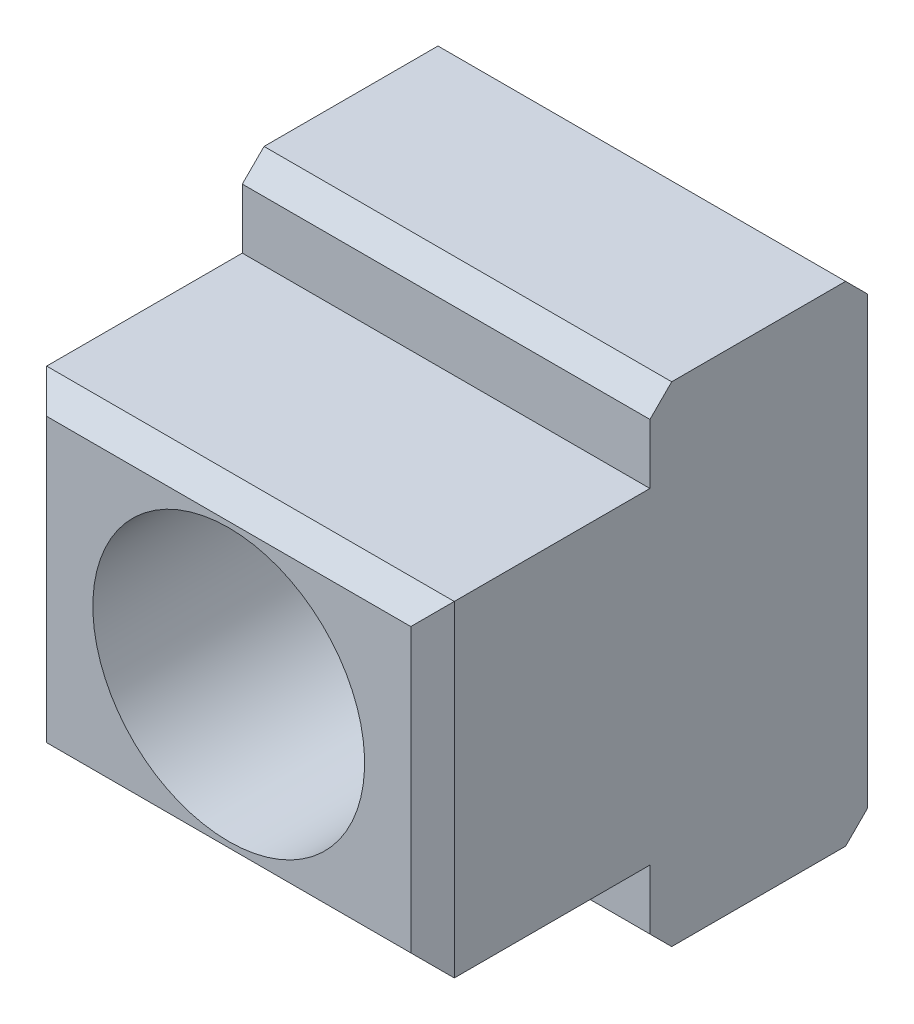
ISO-10303-21;
HEADER;
FILE_DESCRIPTION(('STEP AP214'),'2;1');
FILE_NAME('part.step','',(''),(''),'','','');
FILE_SCHEMA(('AUTOMOTIVE_DESIGN { 1 0 10303 214 1 1 1 1 }'));
ENDSEC;
DATA;
#1=APPLICATION_CONTEXT('core data for automotive mechanical design processes');
#2=APPLICATION_PROTOCOL_DEFINITION('international standard','automotive_design',2000,#1);
#3=PRODUCT_CONTEXT('',#1,'mechanical');
#4=PRODUCT('Part','Part','',(#3));
#5=PRODUCT_RELATED_PRODUCT_CATEGORY('part','',(#4));
#6=PRODUCT_DEFINITION_FORMATION('','',#4);
#7=PRODUCT_DEFINITION_CONTEXT('part definition',#1,'design');
#8=PRODUCT_DEFINITION('design','',#6,#7);
#9=PRODUCT_DEFINITION_SHAPE('','',#8);
#10=(LENGTH_UNIT() NAMED_UNIT(*) SI_UNIT(.MILLI.,.METRE.));
#11=(NAMED_UNIT(*) PLANE_ANGLE_UNIT() SI_UNIT($,.RADIAN.));
#12=(NAMED_UNIT(*) SI_UNIT($,.STERADIAN.) SOLID_ANGLE_UNIT());
#13=UNCERTAINTY_MEASURE_WITH_UNIT(LENGTH_MEASURE(1.E-05),#10,'distance_accuracy_value','');
#14=(GEOMETRIC_REPRESENTATION_CONTEXT(3) GLOBAL_UNCERTAINTY_ASSIGNED_CONTEXT((#13)) GLOBAL_UNIT_ASSIGNED_CONTEXT((#10,
#11,#12)) REPRESENTATION_CONTEXT('',''));
#15=CARTESIAN_POINT('',(0.,0.,0.));
#16=DIRECTION('',(0.,0.,1.));
#17=DIRECTION('',(1.,0.,0.));
#18=AXIS2_PLACEMENT_3D('',#15,#16,#17);
#19=CARTESIAN_POINT('',(9.,9.,0.));
#20=DIRECTION('',(0.,0.,1.));
#21=DIRECTION('',(1.,0.,0.));
#22=AXIS2_PLACEMENT_3D('',#19,#20,#21);
#23=PLANE('',#22);
#24=DIRECTION('',(1.,0.,0.));
#25=VECTOR('',#24,1.);
#26=CARTESIAN_POINT('',(9.,-5.2,0.));
#27=LINE('',#26,#25);
#28=CARTESIAN_POINT('',(-6.7,-5.2,0.));
#29=VERTEX_POINT('',#28);
#30=CARTESIAN_POINT('',(6.7,-5.2,0.));
#31=VERTEX_POINT('',#30);
#32=EDGE_CURVE('E59',#29,#31,#27,.T.);
#33=ORIENTED_EDGE('',*,*,#32,.T.);
#34=DIRECTION('',(0.,1.,0.));
#35=VECTOR('',#34,1.);
#36=CARTESIAN_POINT('',(6.7,9.,0.));
#37=LINE('',#36,#35);
#38=CARTESIAN_POINT('',(6.7,5.2,0.));
#39=VERTEX_POINT('',#38);
#40=EDGE_CURVE('E231',#31,#39,#37,.T.);
#41=ORIENTED_EDGE('',*,*,#40,.T.);
#42=DIRECTION('',(-1.,0.,0.));
#43=VECTOR('',#42,1.);
#44=CARTESIAN_POINT('',(-7.5,5.2,0.));
#45=LINE('',#44,#43);
#46=CARTESIAN_POINT('',(-6.7,5.2,0.));
#47=VERTEX_POINT('',#46);
#48=EDGE_CURVE('E227',#39,#47,#45,.T.);
#49=ORIENTED_EDGE('',*,*,#48,.T.);
#50=DIRECTION('',(0.,-1.,0.));
#51=VECTOR('',#50,1.);
#52=CARTESIAN_POINT('',(-6.7,9.,0.));
#53=LINE('',#52,#51);
#54=EDGE_CURVE('E64',#47,#29,#53,.T.);
#55=ORIENTED_EDGE('',*,*,#54,.T.);
#56=EDGE_LOOP('',(#33,#41,#49,#55));
#57=FACE_BOUND('',#56,.T.);
#58=CARTESIAN_POINT('',(0.,0.,0.));
#59=DIRECTION('',(0.,0.,-1.));
#60=DIRECTION('',(0.,1.,0.));
#61=AXIS2_PLACEMENT_3D('',#58,#59,#60);
#62=CIRCLE('',#61,5.00000000000001);
#63=CARTESIAN_POINT('',(0.,5.00000000000001,0.));
#64=VERTEX_POINT('',#63);
#65=EDGE_CURVE('E171',#64,#64,#62,.T.);
#66=ORIENTED_EDGE('',*,*,#65,.T.);
#67=EDGE_LOOP('',(#66));
#68=FACE_BOUND('',#67,.T.);
#69=ADVANCED_FACE('F42',(#57,#68),#23,.T.);
#70=CARTESIAN_POINT('',(-8.2,9.,0.));
#71=DIRECTION('',(0.,-1.,0.));
#72=DIRECTION('',(1.,0.,0.));
#73=AXIS2_PLACEMENT_3D('',#70,#71,#72);
#74=PLANE('',#73);
#75=DIRECTION('',(0.,0.,1.));
#76=VECTOR('',#75,1.);
#77=CARTESIAN_POINT('',(7.5,9.,-30.1));
#78=LINE('',#77,#76);
#79=CARTESIAN_POINT('',(7.5,9.,-15.2));
#80=VERTEX_POINT('',#79);
#81=CARTESIAN_POINT('',(7.5,9.,-8.8));
#82=VERTEX_POINT('',#81);
#83=EDGE_CURVE('E251',#80,#82,#78,.T.);
#84=ORIENTED_EDGE('',*,*,#83,.F.);
#85=DIRECTION('',(-1.,0.,0.));
#86=VECTOR('',#85,1.);
#87=CARTESIAN_POINT('',(-7.49999999999999,9.,-15.2));
#88=LINE('',#87,#86);
#89=CARTESIAN_POINT('',(-7.5,9.,-15.2));
#90=VERTEX_POINT('',#89);
#91=EDGE_CURVE('E191',#80,#90,#88,.T.);
#92=ORIENTED_EDGE('',*,*,#91,.T.);
#93=DIRECTION('',(0.,0.,1.));
#94=VECTOR('',#93,1.);
#95=CARTESIAN_POINT('',(-7.5,9.,-30.1));
#96=LINE('',#95,#94);
#97=CARTESIAN_POINT('',(-7.5,9.,-8.80000000000001));
#98=VERTEX_POINT('',#97);
#99=EDGE_CURVE('E165',#90,#98,#96,.T.);
#100=ORIENTED_EDGE('',*,*,#99,.T.);
#101=DIRECTION('',(1.,0.,0.));
#102=VECTOR('',#101,1.);
#103=CARTESIAN_POINT('',(-8.2,9.,-8.80000000000001));
#104=LINE('',#103,#102);
#105=EDGE_CURVE('E189',#98,#82,#104,.T.);
#106=ORIENTED_EDGE('',*,*,#105,.T.);
#107=EDGE_LOOP('',(#84,#92,#100,#106));
#108=FACE_BOUND('',#107,.T.);
#109=ADVANCED_FACE('F285',(#108),#74,.F.);
#110=CARTESIAN_POINT('',(-9.,-9.,-14.));
#111=DIRECTION('',(0.,1.,0.));
#112=DIRECTION('',(-1.,0.,0.));
#113=AXIS2_PLACEMENT_3D('',#110,#111,#112);
#114=PLANE('',#113);
#115=DIRECTION('',(0.,0.,1.));
#116=VECTOR('',#115,1.);
#117=CARTESIAN_POINT('',(-7.5,-9.,-30.1));
#118=LINE('',#117,#116);
#119=CARTESIAN_POINT('',(-7.5,-9.,-15.2));
#120=VERTEX_POINT('',#119);
#121=CARTESIAN_POINT('',(-7.5,-9.,-8.8));
#122=VERTEX_POINT('',#121);
#123=EDGE_CURVE('E242',#120,#122,#118,.T.);
#124=ORIENTED_EDGE('',*,*,#123,.F.);
#125=DIRECTION('',(1.,0.,0.));
#126=VECTOR('',#125,1.);
#127=CARTESIAN_POINT('',(7.5,-9.,-15.2));
#128=LINE('',#127,#126);
#129=CARTESIAN_POINT('',(7.5,-9.,-15.2));
#130=VERTEX_POINT('',#129);
#131=EDGE_CURVE('E224',#120,#130,#128,.T.);
#132=ORIENTED_EDGE('',*,*,#131,.T.);
#133=DIRECTION('',(0.,0.,1.));
#134=VECTOR('',#133,1.);
#135=CARTESIAN_POINT('',(7.5,-9.,-30.1));
#136=LINE('',#135,#134);
#137=CARTESIAN_POINT('',(7.5,-9.,-8.8));
#138=VERTEX_POINT('',#137);
#139=EDGE_CURVE('E246',#130,#138,#136,.T.);
#140=ORIENTED_EDGE('',*,*,#139,.T.);
#141=DIRECTION('',(-1.,0.,0.));
#142=VECTOR('',#141,1.);
#143=CARTESIAN_POINT('',(-9.,-9.,-8.8));
#144=LINE('',#143,#142);
#145=EDGE_CURVE('E221',#138,#122,#144,.T.);
#146=ORIENTED_EDGE('',*,*,#145,.T.);
#147=EDGE_LOOP('',(#124,#132,#140,#146));
#148=FACE_BOUND('',#147,.T.);
#149=ADVANCED_FACE('F346',(#148),#114,.F.);
#150=CARTESIAN_POINT('',(9.,6.,-8.));
#151=DIRECTION('',(0.,-1.,0.));
#152=DIRECTION('',(0.,0.,-1.));
#153=AXIS2_PLACEMENT_3D('',#150,#151,#152);
#154=PLANE('',#153);
#155=DIRECTION('',(0.,0.,-1.));
#156=VECTOR('',#155,1.);
#157=CARTESIAN_POINT('',(-7.5,6.,-8.));
#158=LINE('',#157,#156);
#159=CARTESIAN_POINT('',(-7.5,6.,-0.800000000000002));
#160=VERTEX_POINT('',#159);
#161=CARTESIAN_POINT('',(-7.5,6.,-8.));
#162=VERTEX_POINT('',#161);
#163=EDGE_CURVE('E172',#160,#162,#158,.T.);
#164=ORIENTED_EDGE('',*,*,#163,.F.);
#165=DIRECTION('',(1.,0.,0.));
#166=VECTOR('',#165,1.);
#167=CARTESIAN_POINT('',(7.5,6.,-0.800000000000001));
#168=LINE('',#167,#166);
#169=CARTESIAN_POINT('',(7.5,6.,-0.800000000000002));
#170=VERTEX_POINT('',#169);
#171=EDGE_CURVE('E13',#160,#170,#168,.T.);
#172=ORIENTED_EDGE('',*,*,#171,.T.);
#173=DIRECTION('',(0.,0.,1.));
#174=VECTOR('',#173,1.);
#175=CARTESIAN_POINT('',(7.5,6.,-8.));
#176=LINE('',#175,#174);
#177=CARTESIAN_POINT('',(7.5,6.,-8.));
#178=VERTEX_POINT('',#177);
#179=EDGE_CURVE('E256',#178,#170,#176,.T.);
#180=ORIENTED_EDGE('',*,*,#179,.F.);
#181=DIRECTION('',(-1.,0.,0.));
#182=VECTOR('',#181,1.);
#183=CARTESIAN_POINT('',(9.,6.,-8.));
#184=LINE('',#183,#182);
#185=EDGE_CURVE('E175',#178,#162,#184,.T.);
#186=ORIENTED_EDGE('',*,*,#185,.T.);
#187=EDGE_LOOP('',(#164,#172,#180,#186));
#188=FACE_BOUND('',#187,.T.);
#189=ADVANCED_FACE('F273',(#188),#154,.F.);
#190=CARTESIAN_POINT('',(9.,9.,-8.));
#191=DIRECTION('',(0.,0.,-1.));
#192=DIRECTION('',(-1.,0.,0.));
#193=AXIS2_PLACEMENT_3D('',#190,#191,#192);
#194=PLANE('',#193);
#195=DIRECTION('',(0.,-1.,0.));
#196=VECTOR('',#195,1.);
#197=CARTESIAN_POINT('',(7.5,9.,-8.));
#198=LINE('',#197,#196);
#199=CARTESIAN_POINT('',(7.5,8.2,-8.));
#200=VERTEX_POINT('',#199);
#201=EDGE_CURVE('E156',#200,#178,#198,.T.);
#202=ORIENTED_EDGE('',*,*,#201,.F.);
#203=DIRECTION('',(-1.,0.,0.));
#204=VECTOR('',#203,1.);
#205=CARTESIAN_POINT('',(9.,8.2,-8.));
#206=LINE('',#205,#204);
#207=CARTESIAN_POINT('',(-7.5,8.20000000000001,-8.));
#208=VERTEX_POINT('',#207);
#209=EDGE_CURVE('E218',#200,#208,#206,.T.);
#210=ORIENTED_EDGE('',*,*,#209,.T.);
#211=DIRECTION('',(0.,1.,0.));
#212=VECTOR('',#211,1.);
#213=CARTESIAN_POINT('',(-7.5,9.,-8.));
#214=LINE('',#213,#212);
#215=EDGE_CURVE('E177',#162,#208,#214,.T.);
#216=ORIENTED_EDGE('',*,*,#215,.F.);
#217=ORIENTED_EDGE('',*,*,#185,.F.);
#218=EDGE_LOOP('',(#202,#210,#216,#217));
#219=FACE_BOUND('',#218,.T.);
#220=ADVANCED_FACE('F269',(#219),#194,.F.);
#221=CARTESIAN_POINT('',(17.0224350504518,-6.,0.));
#222=DIRECTION('',(0.,-1.,0.));
#223=DIRECTION('',(0.,0.,-1.));
#224=AXIS2_PLACEMENT_3D('',#221,#222,#223);
#225=PLANE('',#224);
#226=DIRECTION('',(0.,0.,1.));
#227=VECTOR('',#226,1.);
#228=CARTESIAN_POINT('',(7.5,-6.,0.));
#229=LINE('',#228,#227);
#230=CARTESIAN_POINT('',(7.5,-6.,-8.));
#231=VERTEX_POINT('',#230);
#232=CARTESIAN_POINT('',(7.5,-6.,-0.800000000000001));
#233=VERTEX_POINT('',#232);
#234=EDGE_CURVE('E145',#231,#233,#229,.T.);
#235=ORIENTED_EDGE('',*,*,#234,.T.);
#236=DIRECTION('',(-1.,0.,0.));
#237=VECTOR('',#236,1.);
#238=CARTESIAN_POINT('',(17.0224350504518,-6.,-0.800000000000001));
#239=LINE('',#238,#237);
#240=CARTESIAN_POINT('',(-7.5,-6.,-0.800000000000002));
#241=VERTEX_POINT('',#240);
#242=EDGE_CURVE('E51',#233,#241,#239,.T.);
#243=ORIENTED_EDGE('',*,*,#242,.T.);
#244=DIRECTION('',(0.,0.,-1.));
#245=VECTOR('',#244,1.);
#246=CARTESIAN_POINT('',(-7.5,-6.,0.));
#247=LINE('',#246,#245);
#248=CARTESIAN_POINT('',(-7.5,-6.,-8.));
#249=VERTEX_POINT('',#248);
#250=EDGE_CURVE('E169',#241,#249,#247,.T.);
#251=ORIENTED_EDGE('',*,*,#250,.T.);
#252=DIRECTION('',(-1.,0.,0.));
#253=VECTOR('',#252,1.);
#254=CARTESIAN_POINT('',(14.3,-6.,-8.));
#255=LINE('',#254,#253);
#256=EDGE_CURVE('E162',#231,#249,#255,.T.);
#257=ORIENTED_EDGE('',*,*,#256,.F.);
#258=EDGE_LOOP('',(#235,#243,#251,#257));
#259=FACE_BOUND('',#258,.T.);
#260=ADVANCED_FACE('F167',(#259),#225,.T.);
#261=CARTESIAN_POINT('',(14.3,-6.,-8.));
#262=DIRECTION('',(0.,0.,-1.));
#263=DIRECTION('',(-1.,0.,0.));
#264=AXIS2_PLACEMENT_3D('',#261,#262,#263);
#265=PLANE('',#264);
#266=DIRECTION('',(0.,1.,0.));
#267=VECTOR('',#266,1.);
#268=CARTESIAN_POINT('',(-7.5,-6.,-8.));
#269=LINE('',#268,#267);
#270=CARTESIAN_POINT('',(-7.5,-8.2,-8.));
#271=VERTEX_POINT('',#270);
#272=EDGE_CURVE('E258',#271,#249,#269,.T.);
#273=ORIENTED_EDGE('',*,*,#272,.F.);
#274=DIRECTION('',(1.,0.,0.));
#275=VECTOR('',#274,1.);
#276=CARTESIAN_POINT('',(14.3,-8.2,-8.));
#277=LINE('',#276,#275);
#278=CARTESIAN_POINT('',(7.5,-8.2,-8.));
#279=VERTEX_POINT('',#278);
#280=EDGE_CURVE('E164',#271,#279,#277,.T.);
#281=ORIENTED_EDGE('',*,*,#280,.T.);
#282=DIRECTION('',(0.,-1.,0.));
#283=VECTOR('',#282,1.);
#284=CARTESIAN_POINT('',(7.5,-6.,-8.));
#285=LINE('',#284,#283);
#286=EDGE_CURVE('E149',#231,#279,#285,.T.);
#287=ORIENTED_EDGE('',*,*,#286,.F.);
#288=ORIENTED_EDGE('',*,*,#256,.T.);
#289=EDGE_LOOP('',(#273,#281,#287,#288));
#290=FACE_BOUND('',#289,.T.);
#291=ADVANCED_FACE('F161',(#290),#265,.F.);
#292=CARTESIAN_POINT('',(28.6977156035922,9.,-16.));
#293=DIRECTION('',(0.,0.,-1.));
#294=DIRECTION('',(-1.,0.,0.));
#295=AXIS2_PLACEMENT_3D('',#292,#293,#294);
#296=PLANE('',#295);
#297=CARTESIAN_POINT('',(0.,0.,-16.));
#298=DIRECTION('',(0.,0.,-1.));
#299=DIRECTION('',(-1.,0.,0.));
#300=AXIS2_PLACEMENT_3D('',#297,#298,#299);
#301=CIRCLE('',#300,5.00000000000001);
#302=CARTESIAN_POINT('',(-5.00000000000001,0.,-16.));
#303=VERTEX_POINT('',#302);
#304=EDGE_CURVE('E46',#303,#303,#301,.T.);
#305=ORIENTED_EDGE('',*,*,#304,.F.);
#306=EDGE_LOOP('',(#305));
#307=FACE_BOUND('',#306,.T.);
#308=DIRECTION('',(0.,1.,0.));
#309=VECTOR('',#308,1.);
#310=CARTESIAN_POINT('',(-7.5,9.,-16.));
#311=LINE('',#310,#309);
#312=CARTESIAN_POINT('',(-7.5,-8.2,-16.));
#313=VERTEX_POINT('',#312);
#314=CARTESIAN_POINT('',(-7.5,8.2,-16.));
#315=VERTEX_POINT('',#314);
#316=EDGE_CURVE('E186',#313,#315,#311,.T.);
#317=ORIENTED_EDGE('',*,*,#316,.T.);
#318=DIRECTION('',(1.,0.,0.));
#319=VECTOR('',#318,1.);
#320=CARTESIAN_POINT('',(7.5,8.19999999999999,-16.));
#321=LINE('',#320,#319);
#322=CARTESIAN_POINT('',(7.5,8.19999999999999,-16.));
#323=VERTEX_POINT('',#322);
#324=EDGE_CURVE('E207',#315,#323,#321,.T.);
#325=ORIENTED_EDGE('',*,*,#324,.T.);
#326=DIRECTION('',(0.,-1.,0.));
#327=VECTOR('',#326,1.);
#328=CARTESIAN_POINT('',(7.5,9.,-16.));
#329=LINE('',#328,#327);
#330=CARTESIAN_POINT('',(7.5,-8.2,-16.));
#331=VERTEX_POINT('',#330);
#332=EDGE_CURVE('E183',#323,#331,#329,.T.);
#333=ORIENTED_EDGE('',*,*,#332,.T.);
#334=DIRECTION('',(-1.,0.,0.));
#335=VECTOR('',#334,1.);
#336=CARTESIAN_POINT('',(-7.5,-8.2,-16.));
#337=LINE('',#336,#335);
#338=EDGE_CURVE('E204',#331,#313,#337,.T.);
#339=ORIENTED_EDGE('',*,*,#338,.T.);
#340=EDGE_LOOP('',(#317,#325,#333,#339));
#341=FACE_BOUND('',#340,.T.);
#342=ADVANCED_FACE('F292',(#307,#341),#296,.T.);
#343=CARTESIAN_POINT('',(0.,0.,-14.));
#344=DIRECTION('',(0.,0.,-1.));
#345=DIRECTION('',(0.,1.,0.));
#346=AXIS2_PLACEMENT_3D('',#343,#344,#345);
#347=CYLINDRICAL_SURFACE('',#346,5.00000000000001);
#348=ORIENTED_EDGE('',*,*,#65,.F.);
#349=EDGE_LOOP('',(#348));
#350=FACE_BOUND('',#349,.T.);
#351=ORIENTED_EDGE('',*,*,#304,.T.);
#352=EDGE_LOOP('',(#351));
#353=FACE_BOUND('',#352,.T.);
#354=ADVANCED_FACE('F289',(#350,#353),#347,.F.);
#355=CARTESIAN_POINT('',(7.5,-9.,-30.1));
#356=DIRECTION('',(1.,0.,0.));
#357=DIRECTION('',(0.,0.,-1.));
#358=AXIS2_PLACEMENT_3D('',#355,#356,#357);
#359=PLANE('',#358);
#360=ORIENTED_EDGE('',*,*,#332,.F.);
#361=DIRECTION('',(0.,0.707106781186549,0.707106781186546));
#362=VECTOR('',#361,1.);
#363=CARTESIAN_POINT('',(7.5,-7.45000000000004,-31.65));
#364=LINE('',#363,#362);
#365=EDGE_CURVE('E216',#323,#80,#364,.T.);
#366=ORIENTED_EDGE('',*,*,#365,.T.);
#367=ORIENTED_EDGE('',*,*,#83,.T.);
#368=DIRECTION('',(0.,0.707106781186546,-0.707106781186549));
#369=VECTOR('',#368,1.);
#370=CARTESIAN_POINT('',(7.5,10.65,-10.45));
#371=LINE('',#370,#369);
#372=EDGE_CURVE('E214',#82,#200,#371,.F.);
#373=ORIENTED_EDGE('',*,*,#372,.T.);
#374=ORIENTED_EDGE('',*,*,#201,.T.);
#375=ORIENTED_EDGE('',*,*,#179,.T.);
#376=DIRECTION('',(0.,-1.,0.));
#377=VECTOR('',#376,1.);
#378=CARTESIAN_POINT('',(7.5,-9.,-0.800000000000002));
#379=LINE('',#378,#377);
#380=EDGE_CURVE('E153',#170,#233,#379,.T.);
#381=ORIENTED_EDGE('',*,*,#380,.T.);
#382=ORIENTED_EDGE('',*,*,#234,.F.);
#383=ORIENTED_EDGE('',*,*,#286,.T.);
#384=DIRECTION('',(0.,0.707106781186549,0.707106781186546));
#385=VECTOR('',#384,1.);
#386=CARTESIAN_POINT('',(7.5,-19.65,-19.4499999999999));
#387=LINE('',#386,#385);
#388=EDGE_CURVE('E210',#279,#138,#387,.F.);
#389=ORIENTED_EDGE('',*,*,#388,.T.);
#390=ORIENTED_EDGE('',*,*,#139,.F.);
#391=DIRECTION('',(0.,0.707106781186546,-0.707106781186549));
#392=VECTOR('',#391,1.);
#393=CARTESIAN_POINT('',(7.5,-1.55,-22.65));
#394=LINE('',#393,#392);
#395=EDGE_CURVE('E212',#130,#331,#394,.T.);
#396=ORIENTED_EDGE('',*,*,#395,.T.);
#397=EDGE_LOOP('',(#360,#366,#367,#373,#374,#375,#381,#382,#383,#389,#390,#396));
#398=FACE_BOUND('',#397,.T.);
#399=ADVANCED_FACE('F148',(#398),#359,.T.);
#400=CARTESIAN_POINT('',(-7.5,-9.,-30.1));
#401=DIRECTION('',(-1.,0.,0.));
#402=DIRECTION('',(0.,0.,1.));
#403=AXIS2_PLACEMENT_3D('',#400,#401,#402);
#404=PLANE('',#403);
#405=ORIENTED_EDGE('',*,*,#99,.F.);
#406=DIRECTION('',(0.,-0.707106781186549,-0.707106781186546));
#407=VECTOR('',#406,1.);
#408=CARTESIAN_POINT('',(-7.5,-7.45000000000004,-31.65));
#409=LINE('',#408,#407);
#410=EDGE_CURVE('E202',#90,#315,#409,.T.);
#411=ORIENTED_EDGE('',*,*,#410,.T.);
#412=ORIENTED_EDGE('',*,*,#316,.F.);
#413=DIRECTION('',(0.,-0.707106781186546,0.707106781186549));
#414=VECTOR('',#413,1.);
#415=CARTESIAN_POINT('',(-7.5,-1.55,-22.65));
#416=LINE('',#415,#414);
#417=EDGE_CURVE('E198',#313,#120,#416,.T.);
#418=ORIENTED_EDGE('',*,*,#417,.T.);
#419=ORIENTED_EDGE('',*,*,#123,.T.);
#420=DIRECTION('',(0.,-0.707106781186549,-0.707106781186546));
#421=VECTOR('',#420,1.);
#422=CARTESIAN_POINT('',(-7.5,-19.65,-19.4499999999999));
#423=LINE('',#422,#421);
#424=EDGE_CURVE('E196',#122,#271,#423,.F.);
#425=ORIENTED_EDGE('',*,*,#424,.T.);
#426=ORIENTED_EDGE('',*,*,#272,.T.);
#427=ORIENTED_EDGE('',*,*,#250,.F.);
#428=DIRECTION('',(0.,1.,0.));
#429=VECTOR('',#428,1.);
#430=CARTESIAN_POINT('',(-7.5,-9.,-0.800000000000002));
#431=LINE('',#430,#429);
#432=EDGE_CURVE('E194',#241,#160,#431,.T.);
#433=ORIENTED_EDGE('',*,*,#432,.T.);
#434=ORIENTED_EDGE('',*,*,#163,.T.);
#435=ORIENTED_EDGE('',*,*,#215,.T.);
#436=DIRECTION('',(0.,-0.707106781186546,0.707106781186549));
#437=VECTOR('',#436,1.);
#438=CARTESIAN_POINT('',(-7.5,10.65,-10.45));
#439=LINE('',#438,#437);
#440=EDGE_CURVE('E200',#208,#98,#439,.F.);
#441=ORIENTED_EDGE('',*,*,#440,.T.);
#442=EDGE_LOOP('',(#405,#411,#412,#418,#419,#425,#426,#427,#433,#434,#435,#441));
#443=FACE_BOUND('',#442,.T.);
#444=ADVANCED_FACE('F263',(#443),#404,.T.);
#445=CARTESIAN_POINT('',(-8.2,9.,-15.2));
#446=DIRECTION('',(0.,0.707106781186546,-0.707106781186549));
#447=DIRECTION('',(0.,0.707106781186549,0.707106781186546));
#448=AXIS2_PLACEMENT_3D('',#445,#446,#447);
#449=PLANE('',#448);
#450=ORIENTED_EDGE('',*,*,#365,.F.);
#451=ORIENTED_EDGE('',*,*,#324,.F.);
#452=ORIENTED_EDGE('',*,*,#410,.F.);
#453=ORIENTED_EDGE('',*,*,#91,.F.);
#454=EDGE_LOOP('',(#450,#451,#452,#453));
#455=FACE_BOUND('',#454,.T.);
#456=ADVANCED_FACE('F305',(#455),#449,.T.);
#457=CARTESIAN_POINT('',(9.,8.2,-8.));
#458=DIRECTION('',(0.,-0.707106781186549,-0.707106781186546));
#459=DIRECTION('',(0.,0.707106781186546,-0.707106781186549));
#460=AXIS2_PLACEMENT_3D('',#457,#458,#459);
#461=PLANE('',#460);
#462=ORIENTED_EDGE('',*,*,#372,.F.);
#463=ORIENTED_EDGE('',*,*,#105,.F.);
#464=ORIENTED_EDGE('',*,*,#440,.F.);
#465=ORIENTED_EDGE('',*,*,#209,.F.);
#466=EDGE_LOOP('',(#462,#463,#464,#465));
#467=FACE_BOUND('',#466,.T.);
#468=ADVANCED_FACE('F314',(#467),#461,.F.);
#469=CARTESIAN_POINT('',(28.6977156035922,-8.2,-16.));
#470=DIRECTION('',(0.,-0.707106781186549,-0.707106781186546));
#471=DIRECTION('',(0.,0.707106781186546,-0.707106781186549));
#472=AXIS2_PLACEMENT_3D('',#469,#470,#471);
#473=PLANE('',#472);
#474=ORIENTED_EDGE('',*,*,#395,.F.);
#475=ORIENTED_EDGE('',*,*,#131,.F.);
#476=ORIENTED_EDGE('',*,*,#417,.F.);
#477=ORIENTED_EDGE('',*,*,#338,.F.);
#478=EDGE_LOOP('',(#474,#475,#476,#477));
#479=FACE_BOUND('',#478,.T.);
#480=ADVANCED_FACE('F316',(#479),#473,.T.);
#481=CARTESIAN_POINT('',(-9.,-9.,-8.8));
#482=DIRECTION('',(0.,0.707106781186546,-0.707106781186549));
#483=DIRECTION('',(0.,0.707106781186549,0.707106781186546));
#484=AXIS2_PLACEMENT_3D('',#481,#482,#483);
#485=PLANE('',#484);
#486=ORIENTED_EDGE('',*,*,#388,.F.);
#487=ORIENTED_EDGE('',*,*,#280,.F.);
#488=ORIENTED_EDGE('',*,*,#424,.F.);
#489=ORIENTED_EDGE('',*,*,#145,.F.);
#490=EDGE_LOOP('',(#486,#487,#488,#489));
#491=FACE_BOUND('',#490,.T.);
#492=ADVANCED_FACE('F322',(#491),#485,.F.);
#493=CARTESIAN_POINT('',(-6.7,9.,0.));
#494=DIRECTION('',(0.707106781186549,0.,-0.707106781186546));
#495=DIRECTION('',(-0.707106781186546,0.,-0.707106781186549));
#496=AXIS2_PLACEMENT_3D('',#493,#494,#495);
#497=PLANE('',#496);
#498=DIRECTION('',(-0.577350269189625,0.577350269189625,-0.577350269189627));
#499=VECTOR('',#498,1.);
#500=CARTESIAN_POINT('',(-1.46666666666667,-0.0333333333333193,5.23333333333334));
#501=LINE('',#500,#499);
#502=EDGE_CURVE('E238',#160,#47,#501,.F.);
#503=ORIENTED_EDGE('',*,*,#502,.F.);
#504=ORIENTED_EDGE('',*,*,#432,.F.);
#505=DIRECTION('',(0.577350269189625,0.577350269189625,0.577350269189627));
#506=VECTOR('',#505,1.);
#507=CARTESIAN_POINT('',(-1.96666666666668,-0.466666666666683,4.73333333333334));
#508=LINE('',#507,#506);
#509=EDGE_CURVE('E240',#29,#241,#508,.F.);
#510=ORIENTED_EDGE('',*,*,#509,.F.);
#511=ORIENTED_EDGE('',*,*,#54,.F.);
#512=EDGE_LOOP('',(#503,#504,#510,#511));
#513=FACE_BOUND('',#512,.T.);
#514=ADVANCED_FACE('F44',(#513),#497,.F.);
#515=CARTESIAN_POINT('',(17.0224350504518,-6.,-0.800000000000001));
#516=DIRECTION('',(0.,0.707106781186549,-0.707106781186546));
#517=DIRECTION('',(0.,0.707106781186546,0.707106781186549));
#518=AXIS2_PLACEMENT_3D('',#515,#516,#517);
#519=PLANE('',#518);
#520=ORIENTED_EDGE('',*,*,#509,.T.);
#521=ORIENTED_EDGE('',*,*,#242,.F.);
#522=DIRECTION('',(-0.577350269189625,0.577350269189625,0.577350269189628));
#523=VECTOR('',#522,1.);
#524=CARTESIAN_POINT('',(10.6741450168172,-9.17414501681724,-3.97414501681725));
#525=LINE('',#524,#523);
#526=EDGE_CURVE('E236',#31,#233,#525,.F.);
#527=ORIENTED_EDGE('',*,*,#526,.F.);
#528=ORIENTED_EDGE('',*,*,#32,.F.);
#529=EDGE_LOOP('',(#520,#521,#527,#528));
#530=FACE_BOUND('',#529,.T.);
#531=ADVANCED_FACE('F333',(#530),#519,.F.);
#532=CARTESIAN_POINT('',(9.,5.2,0.));
#533=DIRECTION('',(0.,0.707106781186549,0.707106781186546));
#534=DIRECTION('',(0.,-0.707106781186546,0.707106781186549));
#535=AXIS2_PLACEMENT_3D('',#532,#533,#534);
#536=PLANE('',#535);
#537=ORIENTED_EDGE('',*,*,#502,.T.);
#538=ORIENTED_EDGE('',*,*,#48,.F.);
#539=DIRECTION('',(-0.577350269189625,-0.577350269189625,0.577350269189628));
#540=VECTOR('',#539,1.);
#541=CARTESIAN_POINT('',(7.46666666666667,5.96666666666667,-0.766666666666666));
#542=LINE('',#541,#540);
#543=EDGE_CURVE('E234',#170,#39,#542,.T.);
#544=ORIENTED_EDGE('',*,*,#543,.F.);
#545=ORIENTED_EDGE('',*,*,#171,.F.);
#546=EDGE_LOOP('',(#537,#538,#544,#545));
#547=FACE_BOUND('',#546,.T.);
#548=ADVANCED_FACE('F282',(#547),#536,.T.);
#549=CARTESIAN_POINT('',(6.7,9.,0.));
#550=DIRECTION('',(-0.707106781186549,0.,-0.707106781186546));
#551=DIRECTION('',(-0.707106781186546,0.,0.707106781186549));
#552=AXIS2_PLACEMENT_3D('',#549,#550,#551);
#553=PLANE('',#552);
#554=ORIENTED_EDGE('',*,*,#526,.T.);
#555=ORIENTED_EDGE('',*,*,#380,.F.);
#556=ORIENTED_EDGE('',*,*,#543,.T.);
#557=ORIENTED_EDGE('',*,*,#40,.F.);
#558=EDGE_LOOP('',(#554,#555,#556,#557));
#559=FACE_BOUND('',#558,.T.);
#560=ADVANCED_FACE('F278',(#559),#553,.F.);
#561=CLOSED_SHELL('',(#69,#109,#149,#189,#220,#260,#291,#342,#354,#399,#444,#456,#468,#480,#492,
#514,#531,#548,#560));
#562=MANIFOLD_SOLID_BREP('B2',#561);
#563=ADVANCED_BREP_SHAPE_REPRESENTATION('',(#18,#562),#14);
#564=SHAPE_DEFINITION_REPRESENTATION(#9,#563);
ENDSEC;
END-ISO-10303-21;
